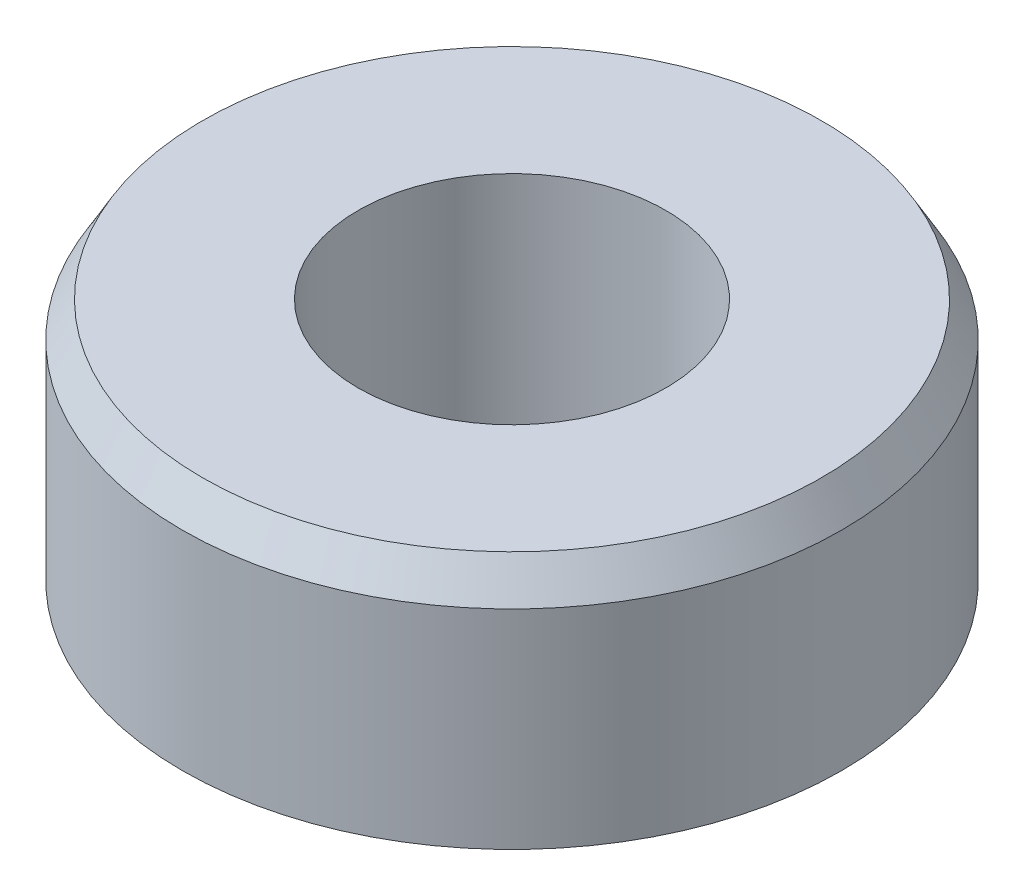
ISO-10303-21;
HEADER;
FILE_DESCRIPTION(('STEP AP214'),'2;1');
FILE_NAME('part.step','',(''),(''),'','','');
FILE_SCHEMA(('AUTOMOTIVE_DESIGN { 1 0 10303 214 1 1 1 1 }'));
ENDSEC;
DATA;
#1=APPLICATION_CONTEXT('core data for automotive mechanical design processes');
#2=APPLICATION_PROTOCOL_DEFINITION('international standard','automotive_design',2000,#1);
#3=PRODUCT_CONTEXT('',#1,'mechanical');
#4=PRODUCT('Part','Part','',(#3));
#5=PRODUCT_RELATED_PRODUCT_CATEGORY('part','',(#4));
#6=PRODUCT_DEFINITION_FORMATION('','',#4);
#7=PRODUCT_DEFINITION_CONTEXT('part definition',#1,'design');
#8=PRODUCT_DEFINITION('design','',#6,#7);
#9=PRODUCT_DEFINITION_SHAPE('','',#8);
#10=(LENGTH_UNIT() NAMED_UNIT(*) SI_UNIT(.MILLI.,.METRE.));
#11=(NAMED_UNIT(*) PLANE_ANGLE_UNIT() SI_UNIT($,.RADIAN.));
#12=(NAMED_UNIT(*) SI_UNIT($,.STERADIAN.) SOLID_ANGLE_UNIT());
#13=UNCERTAINTY_MEASURE_WITH_UNIT(LENGTH_MEASURE(1.E-05),#10,'distance_accuracy_value','');
#14=(GEOMETRIC_REPRESENTATION_CONTEXT(3) GLOBAL_UNCERTAINTY_ASSIGNED_CONTEXT((#13)) GLOBAL_UNIT_ASSIGNED_CONTEXT((#10,
#11,#12)) REPRESENTATION_CONTEXT('',''));
#15=CARTESIAN_POINT('',(0.,0.,0.));
#16=DIRECTION('',(0.,0.,1.));
#17=DIRECTION('',(1.,0.,0.));
#18=AXIS2_PLACEMENT_3D('',#15,#16,#17);
#19=CARTESIAN_POINT('',(0.,3.,0.));
#20=DIRECTION('',(0.,1.,0.));
#21=DIRECTION('',(0.,0.,1.));
#22=AXIS2_PLACEMENT_3D('',#19,#20,#21);
#23=PLANE('',#22);
#24=CARTESIAN_POINT('',(0.,3.,0.));
#25=DIRECTION('',(0.,1.,0.));
#26=DIRECTION('',(0.,0.,1.));
#27=AXIS2_PLACEMENT_3D('',#24,#25,#26);
#28=CIRCLE('',#27,3.51905989232415);
#29=CARTESIAN_POINT('',(0.,3.,3.51905989232415));
#30=VERTEX_POINT('',#29);
#31=EDGE_CURVE('E10',#30,#30,#28,.T.);
#32=ORIENTED_EDGE('',*,*,#31,.T.);
#33=EDGE_LOOP('',(#32));
#34=FACE_BOUND('',#33,.T.);
#35=CARTESIAN_POINT('',(0.,3.,0.));
#36=DIRECTION('',(0.,1.,0.));
#37=DIRECTION('',(0.,0.,1.));
#38=AXIS2_PLACEMENT_3D('',#35,#36,#37);
#39=CIRCLE('',#38,1.75);
#40=CARTESIAN_POINT('',(0.,3.,1.75));
#41=VERTEX_POINT('',#40);
#42=EDGE_CURVE('E58',#41,#41,#39,.T.);
#43=ORIENTED_EDGE('',*,*,#42,.F.);
#44=EDGE_LOOP('',(#43));
#45=FACE_BOUND('',#44,.T.);
#46=ADVANCED_FACE('F37',(#34,#45),#23,.T.);
#47=CARTESIAN_POINT('',(0.,0.,0.));
#48=DIRECTION('',(0.,1.,0.));
#49=DIRECTION('',(0.,0.,1.));
#50=AXIS2_PLACEMENT_3D('',#47,#48,#49);
#51=PLANE('',#50);
#52=CARTESIAN_POINT('',(0.,0.,0.));
#53=DIRECTION('',(0.,1.,0.));
#54=DIRECTION('',(0.,0.,1.));
#55=AXIS2_PLACEMENT_3D('',#52,#53,#54);
#56=CIRCLE('',#55,3.35);
#57=CARTESIAN_POINT('',(0.,0.,3.35));
#58=VERTEX_POINT('',#57);
#59=EDGE_CURVE('E45',#58,#58,#56,.F.);
#60=ORIENTED_EDGE('',*,*,#59,.T.);
#61=EDGE_LOOP('',(#60));
#62=FACE_BOUND('',#61,.T.);
#63=CARTESIAN_POINT('',(0.,0.,0.));
#64=DIRECTION('',(0.,1.,0.));
#65=DIRECTION('',(0.,0.,1.));
#66=AXIS2_PLACEMENT_3D('',#63,#64,#65);
#67=CIRCLE('',#66,1.75);
#68=CARTESIAN_POINT('',(0.,0.,1.75));
#69=VERTEX_POINT('',#68);
#70=EDGE_CURVE('E59',#69,#69,#67,.T.);
#71=ORIENTED_EDGE('',*,*,#70,.T.);
#72=EDGE_LOOP('',(#71));
#73=FACE_BOUND('',#72,.T.);
#74=ADVANCED_FACE('F69',(#62,#73),#51,.F.);
#75=CARTESIAN_POINT('',(0.,3.,0.));
#76=DIRECTION('',(0.,-1.,0.));
#77=DIRECTION('',(0.,0.,-1.));
#78=AXIS2_PLACEMENT_3D('',#75,#76,#77);
#79=CYLINDRICAL_SURFACE('',#78,3.75);
#80=CARTESIAN_POINT('',(0.,0.230940107675851,0.));
#81=DIRECTION('',(0.,1.,0.));
#82=DIRECTION('',(0.,0.,1.));
#83=AXIS2_PLACEMENT_3D('',#80,#81,#82);
#84=CIRCLE('',#83,3.75);
#85=CARTESIAN_POINT('',(0.,0.230940107675851,3.75));
#86=VERTEX_POINT('',#85);
#87=EDGE_CURVE('E49',#86,#86,#84,.T.);
#88=ORIENTED_EDGE('',*,*,#87,.T.);
#89=EDGE_LOOP('',(#88));
#90=FACE_BOUND('',#89,.T.);
#91=CARTESIAN_POINT('',(0.,2.6,0.));
#92=DIRECTION('',(0.,1.,0.));
#93=DIRECTION('',(0.,0.,1.));
#94=AXIS2_PLACEMENT_3D('',#91,#92,#93);
#95=CIRCLE('',#94,3.75);
#96=CARTESIAN_POINT('',(0.,2.6,3.75));
#97=VERTEX_POINT('',#96);
#98=EDGE_CURVE('E53',#97,#97,#95,.F.);
#99=ORIENTED_EDGE('',*,*,#98,.T.);
#100=EDGE_LOOP('',(#99));
#101=FACE_BOUND('',#100,.T.);
#102=ADVANCED_FACE('F74',(#90,#101),#79,.T.);
#103=CARTESIAN_POINT('',(0.,3.,0.));
#104=DIRECTION('',(0.,-1.,0.));
#105=DIRECTION('',(0.,0.,-1.));
#106=AXIS2_PLACEMENT_3D('',#103,#104,#105);
#107=CYLINDRICAL_SURFACE('',#106,1.75);
#108=ORIENTED_EDGE('',*,*,#42,.T.);
#109=EDGE_LOOP('',(#108));
#110=FACE_BOUND('',#109,.T.);
#111=ORIENTED_EDGE('',*,*,#70,.F.);
#112=EDGE_LOOP('',(#111));
#113=FACE_BOUND('',#112,.T.);
#114=ADVANCED_FACE('F65',(#110,#113),#107,.F.);
#115=CARTESIAN_POINT('',(0.,0.230940107675851,0.));
#116=DIRECTION('',(0.,1.,0.));
#117=DIRECTION('',(0.,0.,1.));
#118=AXIS2_PLACEMENT_3D('',#115,#116,#117);
#119=CONICAL_SURFACE('',#118,3.75,1.0471975511966);
#120=ORIENTED_EDGE('',*,*,#59,.F.);
#121=EDGE_LOOP('',(#120));
#122=FACE_BOUND('',#121,.T.);
#123=ORIENTED_EDGE('',*,*,#87,.F.);
#124=EDGE_LOOP('',(#123));
#125=FACE_BOUND('',#124,.T.);
#126=ADVANCED_FACE('F81',(#122,#125),#119,.T.);
#127=CARTESIAN_POINT('',(0.,3.,0.));
#128=DIRECTION('',(0.,-1.,0.));
#129=DIRECTION('',(0.,0.,-1.));
#130=AXIS2_PLACEMENT_3D('',#127,#128,#129);
#131=CONICAL_SURFACE('',#130,3.51905989232415,0.523598775598299);
#132=ORIENTED_EDGE('',*,*,#98,.F.);
#133=EDGE_LOOP('',(#132));
#134=FACE_BOUND('',#133,.T.);
#135=ORIENTED_EDGE('',*,*,#31,.F.);
#136=EDGE_LOOP('',(#135));
#137=FACE_BOUND('',#136,.T.);
#138=ADVANCED_FACE('F40',(#134,#137),#131,.T.);
#139=CLOSED_SHELL('',(#46,#74,#102,#114,#126,#138));
#140=MANIFOLD_SOLID_BREP('B2',#139);
#141=ADVANCED_BREP_SHAPE_REPRESENTATION('',(#18,#140),#14);
#142=SHAPE_DEFINITION_REPRESENTATION(#9,#141);
ENDSEC;
END-ISO-10303-21;
